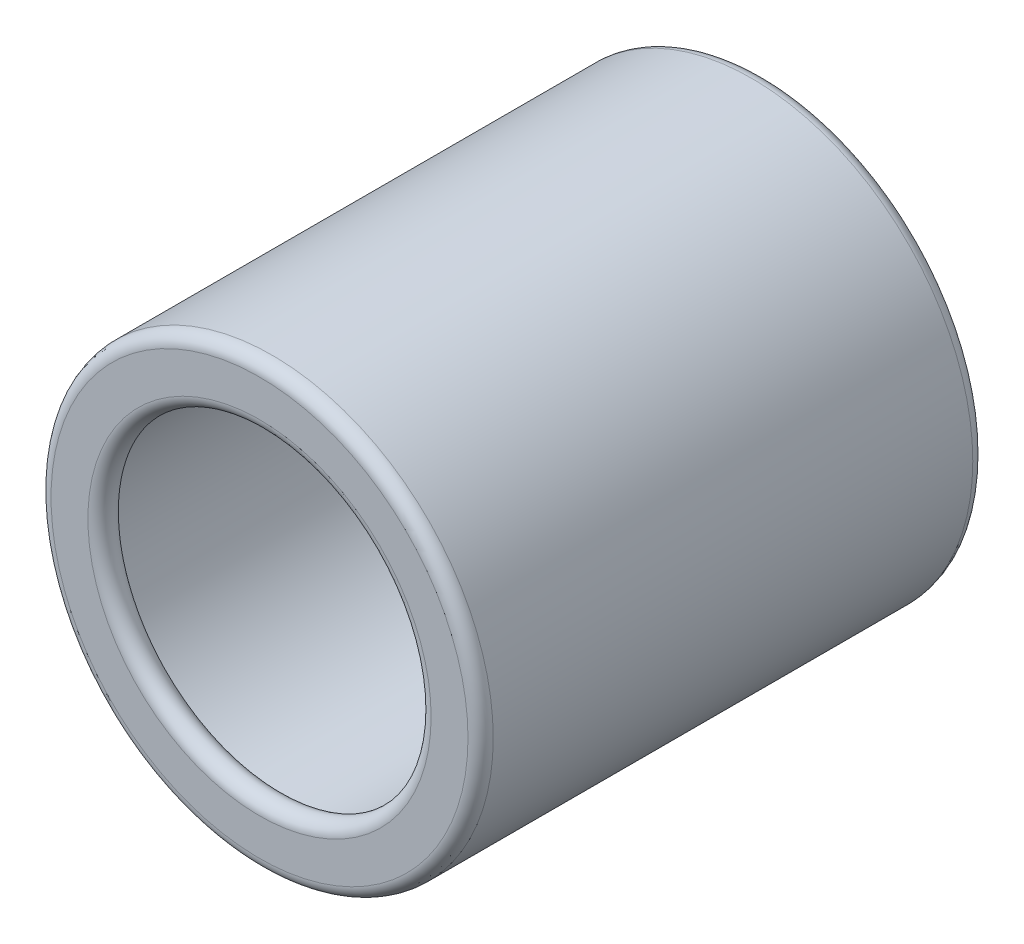
ISO-10303-21;
HEADER;
FILE_DESCRIPTION(('STEP AP214'),'2;1');
FILE_NAME('part.step','',(''),(''),'','','');
FILE_SCHEMA(('AUTOMOTIVE_DESIGN { 1 0 10303 214 1 1 1 1 }'));
ENDSEC;
DATA;
#1=APPLICATION_CONTEXT('core data for automotive mechanical design processes');
#2=APPLICATION_PROTOCOL_DEFINITION('international standard','automotive_design',2000,#1);
#3=PRODUCT_CONTEXT('',#1,'mechanical');
#4=PRODUCT('Part','Part','',(#3));
#5=PRODUCT_RELATED_PRODUCT_CATEGORY('part','',(#4));
#6=PRODUCT_DEFINITION_FORMATION('','',#4);
#7=PRODUCT_DEFINITION_CONTEXT('part definition',#1,'design');
#8=PRODUCT_DEFINITION('design','',#6,#7);
#9=PRODUCT_DEFINITION_SHAPE('','',#8);
#10=(LENGTH_UNIT() NAMED_UNIT(*) SI_UNIT(.MILLI.,.METRE.));
#11=(NAMED_UNIT(*) PLANE_ANGLE_UNIT() SI_UNIT($,.RADIAN.));
#12=(NAMED_UNIT(*) SI_UNIT($,.STERADIAN.) SOLID_ANGLE_UNIT());
#13=UNCERTAINTY_MEASURE_WITH_UNIT(LENGTH_MEASURE(1.E-05),#10,'distance_accuracy_value','');
#14=(GEOMETRIC_REPRESENTATION_CONTEXT(3) GLOBAL_UNCERTAINTY_ASSIGNED_CONTEXT((#13)) GLOBAL_UNIT_ASSIGNED_CONTEXT((#10,
#11,#12)) REPRESENTATION_CONTEXT('',''));
#15=CARTESIAN_POINT('',(0.,0.,0.));
#16=DIRECTION('',(0.,0.,1.));
#17=DIRECTION('',(1.,0.,0.));
#18=AXIS2_PLACEMENT_3D('',#15,#16,#17);
#19=CARTESIAN_POINT('',(0.,0.,31.75));
#20=DIRECTION('',(0.,0.,1.));
#21=DIRECTION('',(1.,0.,0.));
#22=AXIS2_PLACEMENT_3D('',#19,#20,#21);
#23=PLANE('',#22);
#24=CARTESIAN_POINT('',(0.,0.,31.75));
#25=DIRECTION('',(0.,0.,1.));
#26=DIRECTION('',(1.,0.,0.));
#27=AXIS2_PLACEMENT_3D('',#24,#25,#26);
#28=CIRCLE('',#27,10.79375);
#29=CARTESIAN_POINT('',(10.79375,0.,31.75));
#30=VERTEX_POINT('',#29);
#31=EDGE_CURVE('E72',#30,#30,#28,.F.);
#32=ORIENTED_EDGE('',*,*,#31,.T.);
#33=EDGE_LOOP('',(#32));
#34=FACE_BOUND('',#33,.T.);
#35=CARTESIAN_POINT('',(0.,0.,31.75));
#36=DIRECTION('',(0.,0.,1.));
#37=DIRECTION('',(1.,0.,0.));
#38=AXIS2_PLACEMENT_3D('',#35,#36,#37);
#39=CIRCLE('',#38,13.11275);
#40=CARTESIAN_POINT('',(13.11275,0.,31.75));
#41=VERTEX_POINT('',#40);
#42=EDGE_CURVE('E65',#41,#41,#39,.T.);
#43=ORIENTED_EDGE('',*,*,#42,.T.);
#44=EDGE_LOOP('',(#43));
#45=FACE_BOUND('',#44,.T.);
#46=ADVANCED_FACE('F43',(#34,#45),#23,.T.);
#47=CARTESIAN_POINT('',(0.,0.,0.));
#48=DIRECTION('',(0.,0.,1.));
#49=DIRECTION('',(1.,0.,0.));
#50=AXIS2_PLACEMENT_3D('',#47,#48,#49);
#51=PLANE('',#50);
#52=CARTESIAN_POINT('',(0.,0.,0.));
#53=DIRECTION('',(0.,0.,1.));
#54=DIRECTION('',(1.,0.,0.));
#55=AXIS2_PLACEMENT_3D('',#52,#53,#54);
#56=CIRCLE('',#55,10.79375);
#57=CARTESIAN_POINT('',(10.79375,0.,0.));
#58=VERTEX_POINT('',#57);
#59=EDGE_CURVE('E11',#58,#58,#56,.T.);
#60=ORIENTED_EDGE('',*,*,#59,.T.);
#61=EDGE_LOOP('',(#60));
#62=FACE_BOUND('',#61,.T.);
#63=CARTESIAN_POINT('',(0.,0.,0.));
#64=DIRECTION('',(0.,0.,1.));
#65=DIRECTION('',(1.,0.,0.));
#66=AXIS2_PLACEMENT_3D('',#63,#64,#65);
#67=CIRCLE('',#66,13.11275);
#68=CARTESIAN_POINT('',(13.11275,0.,0.));
#69=VERTEX_POINT('',#68);
#70=EDGE_CURVE('E52',#69,#69,#67,.F.);
#71=ORIENTED_EDGE('',*,*,#70,.T.);
#72=EDGE_LOOP('',(#71));
#73=FACE_BOUND('',#72,.T.);
#74=ADVANCED_FACE('F94',(#62,#73),#51,.F.);
#75=CARTESIAN_POINT('',(0.,0.,31.75));
#76=DIRECTION('',(0.,0.,-1.));
#77=DIRECTION('',(-1.,0.,0.));
#78=AXIS2_PLACEMENT_3D('',#75,#76,#77);
#79=CYLINDRICAL_SURFACE('',#78,13.9065);
#80=CARTESIAN_POINT('',(0.,0.,30.95625));
#81=DIRECTION('',(0.,0.,1.));
#82=DIRECTION('',(1.,0.,0.));
#83=AXIS2_PLACEMENT_3D('',#80,#81,#82);
#84=CIRCLE('',#83,13.9065);
#85=CARTESIAN_POINT('',(13.9065,0.,30.95625));
#86=VERTEX_POINT('',#85);
#87=EDGE_CURVE('E59',#86,#86,#84,.F.);
#88=ORIENTED_EDGE('',*,*,#87,.T.);
#89=EDGE_LOOP('',(#88));
#90=FACE_BOUND('',#89,.T.);
#91=CARTESIAN_POINT('',(0.,0.,0.793749999999999));
#92=DIRECTION('',(0.,0.,1.));
#93=DIRECTION('',(1.,0.,0.));
#94=AXIS2_PLACEMENT_3D('',#91,#92,#93);
#95=CIRCLE('',#94,13.9065);
#96=CARTESIAN_POINT('',(13.9065,0.,0.793749999999999));
#97=VERTEX_POINT('',#96);
#98=EDGE_CURVE('E116',#97,#97,#95,.T.);
#99=ORIENTED_EDGE('',*,*,#98,.T.);
#100=EDGE_LOOP('',(#99));
#101=FACE_BOUND('',#100,.T.);
#102=ADVANCED_FACE('F100',(#90,#101),#79,.T.);
#103=CARTESIAN_POINT('',(0.,0.,31.75));
#104=DIRECTION('',(0.,0.,-1.));
#105=DIRECTION('',(-1.,0.,0.));
#106=AXIS2_PLACEMENT_3D('',#103,#104,#105);
#107=CYLINDRICAL_SURFACE('',#106,10.635);
#108=CARTESIAN_POINT('',(0.,0.,30.1785370066663));
#109=DIRECTION('',(0.,0.,1.));
#110=DIRECTION('',(1.,0.,0.));
#111=AXIS2_PLACEMENT_3D('',#108,#109,#110);
#112=CIRCLE('',#111,10.635);
#113=CARTESIAN_POINT('',(10.635,0.,30.1785370066663));
#114=VERTEX_POINT('',#113);
#115=EDGE_CURVE('E62',#114,#114,#112,.T.);
#116=ORIENTED_EDGE('',*,*,#115,.T.);
#117=EDGE_LOOP('',(#116));
#118=FACE_BOUND('',#117,.T.);
#119=CARTESIAN_POINT('',(0.,0.,1.57146299333366));
#120=DIRECTION('',(0.,0.,-1.));
#121=DIRECTION('',(-1.,0.,0.));
#122=AXIS2_PLACEMENT_3D('',#119,#120,#121);
#123=CIRCLE('',#122,10.635);
#124=CARTESIAN_POINT('',(-10.635,0.,1.57146299333366));
#125=VERTEX_POINT('',#124);
#126=EDGE_CURVE('E47',#125,#125,#123,.T.);
#127=ORIENTED_EDGE('',*,*,#126,.T.);
#128=EDGE_LOOP('',(#127));
#129=FACE_BOUND('',#128,.T.);
#130=ADVANCED_FACE('F45',(#118,#129),#107,.F.);
#131=CARTESIAN_POINT('',(0.,0.,30.95625));
#132=DIRECTION('',(0.,0.,1.));
#133=DIRECTION('',(1.,0.,0.));
#134=AXIS2_PLACEMENT_3D('',#131,#132,#133);
#135=TOROIDAL_SURFACE('',#134,10.79375,0.79375);
#136=ORIENTED_EDGE('',*,*,#31,.F.);
#137=EDGE_LOOP('',(#136));
#138=FACE_BOUND('',#137,.T.);
#139=ORIENTED_EDGE('',*,*,#115,.F.);
#140=EDGE_LOOP('',(#139));
#141=FACE_BOUND('',#140,.T.);
#142=ADVANCED_FACE('F90',(#138,#141),#135,.T.);
#143=CARTESIAN_POINT('',(0.,0.,30.95625));
#144=DIRECTION('',(0.,0.,1.));
#145=DIRECTION('',(1.,0.,0.));
#146=AXIS2_PLACEMENT_3D('',#143,#144,#145);
#147=TOROIDAL_SURFACE('',#146,13.11275,0.79375);
#148=ORIENTED_EDGE('',*,*,#87,.F.);
#149=EDGE_LOOP('',(#148));
#150=FACE_BOUND('',#149,.T.);
#151=ORIENTED_EDGE('',*,*,#42,.F.);
#152=EDGE_LOOP('',(#151));
#153=FACE_BOUND('',#152,.T.);
#154=ADVANCED_FACE('F83',(#150,#153),#147,.T.);
#155=CARTESIAN_POINT('',(0.,0.,0.793749999999999));
#156=DIRECTION('',(0.,0.,1.));
#157=DIRECTION('',(1.,0.,0.));
#158=AXIS2_PLACEMENT_3D('',#155,#156,#157);
#159=TOROIDAL_SURFACE('',#158,10.79375,0.79375);
#160=ORIENTED_EDGE('',*,*,#126,.F.);
#161=EDGE_LOOP('',(#160));
#162=FACE_BOUND('',#161,.T.);
#163=ORIENTED_EDGE('',*,*,#59,.F.);
#164=EDGE_LOOP('',(#163));
#165=FACE_BOUND('',#164,.T.);
#166=ADVANCED_FACE('F79',(#162,#165),#159,.T.);
#167=CARTESIAN_POINT('',(0.,0.,0.793749999999999));
#168=DIRECTION('',(0.,0.,1.));
#169=DIRECTION('',(1.,0.,0.));
#170=AXIS2_PLACEMENT_3D('',#167,#168,#169);
#171=TOROIDAL_SURFACE('',#170,13.11275,0.79375);
#172=ORIENTED_EDGE('',*,*,#70,.F.);
#173=EDGE_LOOP('',(#172));
#174=FACE_BOUND('',#173,.T.);
#175=ORIENTED_EDGE('',*,*,#98,.F.);
#176=EDGE_LOOP('',(#175));
#177=FACE_BOUND('',#176,.T.);
#178=ADVANCED_FACE('F82',(#174,#177),#171,.T.);
#179=CLOSED_SHELL('',(#46,#74,#102,#130,#142,#154,#166,#178));
#180=MANIFOLD_SOLID_BREP('B2',#179);
#181=ADVANCED_BREP_SHAPE_REPRESENTATION('',(#18,#180),#14);
#182=SHAPE_DEFINITION_REPRESENTATION(#9,#181);
ENDSEC;
END-ISO-10303-21;
